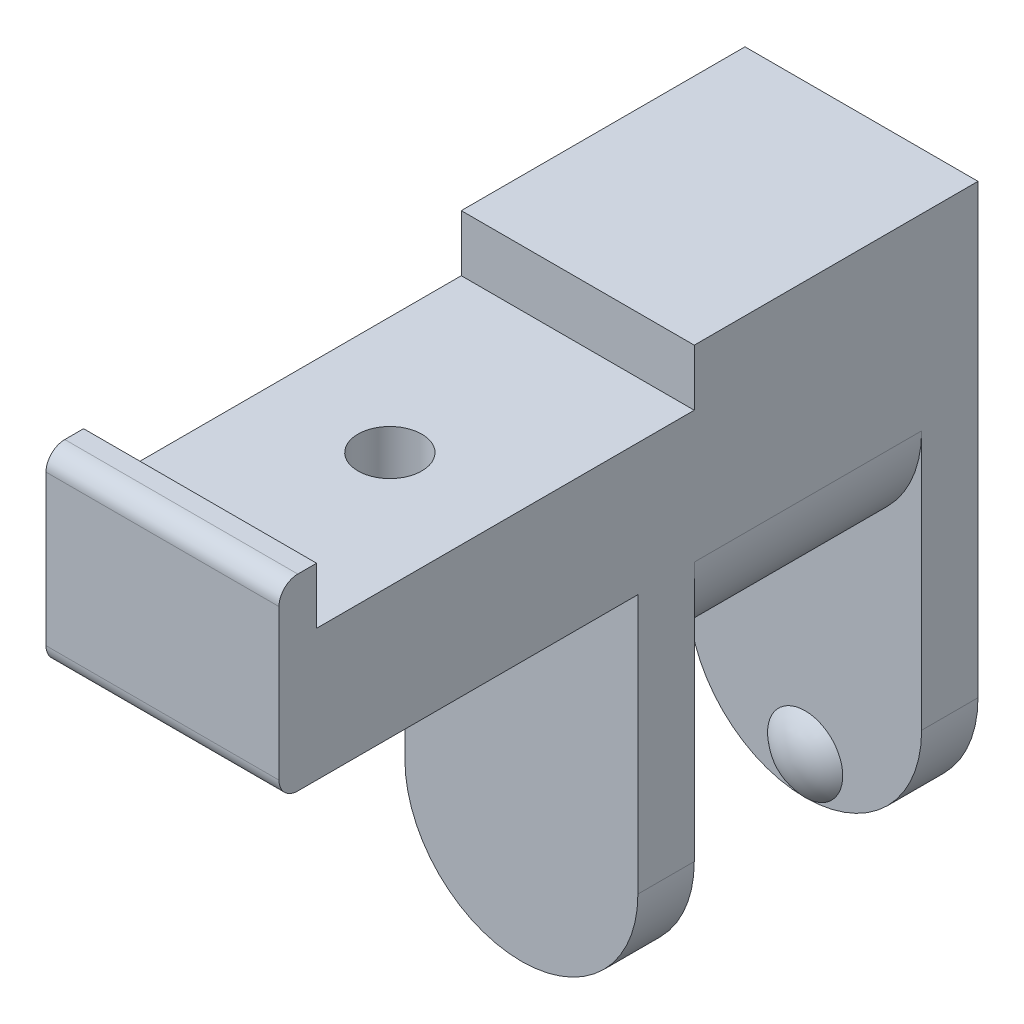
ISO-10303-21;
HEADER;
FILE_DESCRIPTION(('STEP AP214'),'2;1');
FILE_NAME('part.step','',(''),(''),'','','');
FILE_SCHEMA(('AUTOMOTIVE_DESIGN { 1 0 10303 214 1 1 1 1 }'));
ENDSEC;
DATA;
#1=APPLICATION_CONTEXT('core data for automotive mechanical design processes');
#2=APPLICATION_PROTOCOL_DEFINITION('international standard','automotive_design',2000,#1);
#3=PRODUCT_CONTEXT('',#1,'mechanical');
#4=PRODUCT('Part','Part','',(#3));
#5=PRODUCT_RELATED_PRODUCT_CATEGORY('part','',(#4));
#6=PRODUCT_DEFINITION_FORMATION('','',#4);
#7=PRODUCT_DEFINITION_CONTEXT('part definition',#1,'design');
#8=PRODUCT_DEFINITION('design','',#6,#7);
#9=PRODUCT_DEFINITION_SHAPE('','',#8);
#10=(LENGTH_UNIT() NAMED_UNIT(*) SI_UNIT(.MILLI.,.METRE.));
#11=(NAMED_UNIT(*) PLANE_ANGLE_UNIT() SI_UNIT($,.RADIAN.));
#12=(NAMED_UNIT(*) SI_UNIT($,.STERADIAN.) SOLID_ANGLE_UNIT());
#13=UNCERTAINTY_MEASURE_WITH_UNIT(LENGTH_MEASURE(1.E-05),#10,'distance_accuracy_value','');
#14=(GEOMETRIC_REPRESENTATION_CONTEXT(3) GLOBAL_UNCERTAINTY_ASSIGNED_CONTEXT((#13)) GLOBAL_UNIT_ASSIGNED_CONTEXT((#10,
#11,#12)) REPRESENTATION_CONTEXT('',''));
#15=CARTESIAN_POINT('',(0.,0.,0.));
#16=DIRECTION('',(0.,0.,1.));
#17=DIRECTION('',(1.,0.,0.));
#18=AXIS2_PLACEMENT_3D('',#15,#16,#17);
#19=CARTESIAN_POINT('',(12.4,0.,3.));
#20=DIRECTION('',(0.,0.,-1.));
#21=DIRECTION('',(0.,1.,0.));
#22=AXIS2_PLACEMENT_3D('',#19,#20,#21);
#23=PLANE('',#22);
#24=DIRECTION('',(0.,-1.,0.));
#25=VECTOR('',#24,1.);
#26=CARTESIAN_POINT('',(0.,0.,3.));
#27=LINE('',#26,#25);
#28=CARTESIAN_POINT('',(0.,0.,3.));
#29=VERTEX_POINT('',#28);
#30=CARTESIAN_POINT('',(0.,-13.8,3.));
#31=VERTEX_POINT('',#30);
#32=EDGE_CURVE('E257',#29,#31,#27,.T.);
#33=ORIENTED_EDGE('',*,*,#32,.T.);
#34=CARTESIAN_POINT('',(6.2,-13.8,3.));
#35=DIRECTION('',(0.,0.,-1.));
#36=DIRECTION('',(0.,1.,0.));
#37=AXIS2_PLACEMENT_3D('',#34,#35,#36);
#38=CIRCLE('',#37,6.2);
#39=CARTESIAN_POINT('',(12.4,-13.8,3.));
#40=VERTEX_POINT('',#39);
#41=EDGE_CURVE('E282',#31,#40,#38,.F.);
#42=ORIENTED_EDGE('',*,*,#41,.T.);
#43=DIRECTION('',(0.,-1.,0.));
#44=VECTOR('',#43,1.);
#45=CARTESIAN_POINT('',(12.4,0.,3.));
#46=LINE('',#45,#44);
#47=CARTESIAN_POINT('',(12.4,0.,3.));
#48=VERTEX_POINT('',#47);
#49=EDGE_CURVE('E244',#48,#40,#46,.T.);
#50=ORIENTED_EDGE('',*,*,#49,.F.);
#51=DIRECTION('',(-1.,0.,0.));
#52=VECTOR('',#51,1.);
#53=CARTESIAN_POINT('',(12.4,0.,3.));
#54=LINE('',#53,#52);
#55=EDGE_CURVE('E207',#48,#29,#54,.T.);
#56=ORIENTED_EDGE('',*,*,#55,.T.);
#57=EDGE_LOOP('',(#33,#42,#50,#56));
#58=FACE_BOUND('',#57,.T.);
#59=ADVANCED_FACE('F42',(#58),#23,.F.);
#60=CARTESIAN_POINT('',(12.4,0.,0.));
#61=DIRECTION('',(0.,0.,1.));
#62=DIRECTION('',(1.,0.,0.));
#63=AXIS2_PLACEMENT_3D('',#60,#61,#62);
#64=PLANE('',#63);
#65=DIRECTION('',(0.,1.,0.));
#66=VECTOR('',#65,1.);
#67=CARTESIAN_POINT('',(12.4,0.,0.));
#68=LINE('',#67,#66);
#69=CARTESIAN_POINT('',(12.4,-13.8,0.));
#70=VERTEX_POINT('',#69);
#71=CARTESIAN_POINT('',(12.4,0.,0.));
#72=VERTEX_POINT('',#71);
#73=EDGE_CURVE('E297',#70,#72,#68,.T.);
#74=ORIENTED_EDGE('',*,*,#73,.F.);
#75=CARTESIAN_POINT('',(6.2,-13.8,0.));
#76=DIRECTION('',(0.,0.,1.));
#77=DIRECTION('',(1.,0.,0.));
#78=AXIS2_PLACEMENT_3D('',#75,#76,#77);
#79=CIRCLE('',#78,6.2);
#80=CARTESIAN_POINT('',(0.,-13.8,0.));
#81=VERTEX_POINT('',#80);
#82=EDGE_CURVE('E272',#70,#81,#79,.F.);
#83=ORIENTED_EDGE('',*,*,#82,.T.);
#84=DIRECTION('',(0.,1.,0.));
#85=VECTOR('',#84,1.);
#86=CARTESIAN_POINT('',(0.,0.,0.));
#87=LINE('',#86,#85);
#88=CARTESIAN_POINT('',(0.,0.,0.));
#89=VERTEX_POINT('',#88);
#90=EDGE_CURVE('E189',#81,#89,#87,.T.);
#91=ORIENTED_EDGE('',*,*,#90,.T.);
#92=CARTESIAN_POINT('',(6.2,0.,0.));
#93=DIRECTION('',(0.,0.,-1.));
#94=DIRECTION('',(1.,0.,0.));
#95=AXIS2_PLACEMENT_3D('',#92,#93,#94);
#96=CIRCLE('',#95,6.2);
#97=EDGE_CURVE('E271',#72,#89,#96,.T.);
#98=ORIENTED_EDGE('',*,*,#97,.F.);
#99=EDGE_LOOP('',(#74,#83,#91,#98));
#100=FACE_BOUND('',#99,.T.);
#101=ADVANCED_FACE('F270',(#100),#64,.F.);
#102=CARTESIAN_POINT('',(12.4,0.,-12.1));
#103=DIRECTION('',(0.,0.,-1.));
#104=DIRECTION('',(0.,1.,0.));
#105=AXIS2_PLACEMENT_3D('',#102,#103,#104);
#106=PLANE('',#105);
#107=CARTESIAN_POINT('',(6.2,-13.8,-12.1));
#108=DIRECTION('',(0.,0.,-1.));
#109=DIRECTION('',(0.,1.,0.));
#110=AXIS2_PLACEMENT_3D('',#107,#108,#109);
#111=CIRCLE('',#110,6.2);
#112=CARTESIAN_POINT('',(0.,-13.8,-12.1));
#113=VERTEX_POINT('',#112);
#114=CARTESIAN_POINT('',(6.2,-20.,-12.1));
#115=VERTEX_POINT('',#114);
#116=EDGE_CURVE('E164',#113,#115,#111,.F.);
#117=ORIENTED_EDGE('',*,*,#116,.T.);
#118=CARTESIAN_POINT('',(6.2,-18.,-12.1));
#119=DIRECTION('',(0.,0.,1.));
#120=DIRECTION('',(1.,0.,0.));
#121=AXIS2_PLACEMENT_3D('',#118,#119,#120);
#122=CIRCLE('',#121,2.);
#123=EDGE_CURVE('E55',#115,#115,#122,.T.);
#124=ORIENTED_EDGE('',*,*,#123,.F.);
#125=CARTESIAN_POINT('',(12.4,-13.8,-12.1));
#126=VERTEX_POINT('',#125);
#127=EDGE_CURVE('E399',#115,#126,#111,.F.);
#128=ORIENTED_EDGE('',*,*,#127,.T.);
#129=DIRECTION('',(0.,-1.,0.));
#130=VECTOR('',#129,1.);
#131=CARTESIAN_POINT('',(12.4,0.,-12.1));
#132=LINE('',#131,#130);
#133=CARTESIAN_POINT('',(12.4,0.,-12.1));
#134=VERTEX_POINT('',#133);
#135=EDGE_CURVE('E299',#134,#126,#132,.T.);
#136=ORIENTED_EDGE('',*,*,#135,.F.);
#137=CARTESIAN_POINT('',(6.2,0.,-12.1));
#138=DIRECTION('',(0.,0.,-1.));
#139=DIRECTION('',(0.,1.,0.));
#140=AXIS2_PLACEMENT_3D('',#137,#138,#139);
#141=CIRCLE('',#140,6.2);
#142=CARTESIAN_POINT('',(0.,0.,-12.1));
#143=VERTEX_POINT('',#142);
#144=EDGE_CURVE('E285',#134,#143,#141,.T.);
#145=ORIENTED_EDGE('',*,*,#144,.T.);
#146=DIRECTION('',(0.,-1.,0.));
#147=VECTOR('',#146,1.);
#148=CARTESIAN_POINT('',(0.,0.,-12.1));
#149=LINE('',#148,#147);
#150=EDGE_CURVE('E185',#143,#113,#149,.T.);
#151=ORIENTED_EDGE('',*,*,#150,.T.);
#152=EDGE_LOOP('',(#117,#124,#128,#136,#145,#151));
#153=FACE_BOUND('',#152,.T.);
#154=ADVANCED_FACE('F341',(#153),#106,.F.);
#155=CARTESIAN_POINT('',(12.4,0.,-15.1));
#156=DIRECTION('',(0.,0.,1.));
#157=DIRECTION('',(0.,-1.,0.));
#158=AXIS2_PLACEMENT_3D('',#155,#156,#157);
#159=PLANE('',#158);
#160=DIRECTION('',(0.,1.,0.));
#161=VECTOR('',#160,1.);
#162=CARTESIAN_POINT('',(12.4,0.,-15.1));
#163=LINE('',#162,#161);
#164=CARTESIAN_POINT('',(12.4,-13.8,-15.1));
#165=VERTEX_POINT('',#164);
#166=CARTESIAN_POINT('',(12.4,10.,-15.1));
#167=VERTEX_POINT('',#166);
#168=EDGE_CURVE('E176',#165,#167,#163,.T.);
#169=ORIENTED_EDGE('',*,*,#168,.F.);
#170=CARTESIAN_POINT('',(6.2,-13.8,-15.1));
#171=DIRECTION('',(0.,0.,-1.));
#172=DIRECTION('',(1.,0.,0.));
#173=AXIS2_PLACEMENT_3D('',#170,#171,#172);
#174=CIRCLE('',#173,6.2);
#175=CARTESIAN_POINT('',(0.,-13.8,-15.1));
#176=VERTEX_POINT('',#175);
#177=EDGE_CURVE('E160',#165,#176,#174,.T.);
#178=ORIENTED_EDGE('',*,*,#177,.T.);
#179=DIRECTION('',(0.,1.,0.));
#180=VECTOR('',#179,1.);
#181=CARTESIAN_POINT('',(0.,0.,-15.1));
#182=LINE('',#181,#180);
#183=CARTESIAN_POINT('',(0.,10.,-15.1));
#184=VERTEX_POINT('',#183);
#185=EDGE_CURVE('E174',#176,#184,#182,.T.);
#186=ORIENTED_EDGE('',*,*,#185,.T.);
#187=DIRECTION('',(-1.,0.,0.));
#188=VECTOR('',#187,1.);
#189=CARTESIAN_POINT('',(12.4,10.,-15.1));
#190=LINE('',#189,#188);
#191=EDGE_CURVE('E205',#167,#184,#190,.T.);
#192=ORIENTED_EDGE('',*,*,#191,.F.);
#193=EDGE_LOOP('',(#169,#178,#186,#192));
#194=FACE_BOUND('',#193,.T.);
#195=ADVANCED_FACE('F172',(#194),#159,.F.);
#196=CARTESIAN_POINT('',(12.4,0.,20.1));
#197=DIRECTION('',(0.,0.,-1.));
#198=DIRECTION('',(0.,1.,0.));
#199=AXIS2_PLACEMENT_3D('',#196,#197,#198);
#200=PLANE('',#199);
#201=DIRECTION('',(0.,-1.,0.));
#202=VECTOR('',#201,1.);
#203=CARTESIAN_POINT('',(0.,0.,20.1));
#204=LINE('',#203,#202);
#205=CARTESIAN_POINT('',(0.,9.99999999999999,20.1));
#206=VERTEX_POINT('',#205);
#207=CARTESIAN_POINT('',(0.,6.99999999999999,20.1));
#208=VERTEX_POINT('',#207);
#209=EDGE_CURVE('E259',#206,#208,#204,.T.);
#210=ORIENTED_EDGE('',*,*,#209,.F.);
#211=DIRECTION('',(-1.,0.,0.));
#212=VECTOR('',#211,1.);
#213=CARTESIAN_POINT('',(12.4,9.99999999999999,20.1));
#214=LINE('',#213,#212);
#215=CARTESIAN_POINT('',(12.4,9.99999999999999,20.1));
#216=VERTEX_POINT('',#215);
#217=EDGE_CURVE('E210',#216,#206,#214,.T.);
#218=ORIENTED_EDGE('',*,*,#217,.F.);
#219=DIRECTION('',(0.,-1.,0.));
#220=VECTOR('',#219,1.);
#221=CARTESIAN_POINT('',(12.4,0.,20.1));
#222=LINE('',#221,#220);
#223=CARTESIAN_POINT('',(12.4,6.99999999999999,20.1));
#224=VERTEX_POINT('',#223);
#225=EDGE_CURVE('E197',#216,#224,#222,.T.);
#226=ORIENTED_EDGE('',*,*,#225,.T.);
#227=DIRECTION('',(-1.,0.,0.));
#228=VECTOR('',#227,1.);
#229=CARTESIAN_POINT('',(12.4,6.99999999999999,20.1));
#230=LINE('',#229,#228);
#231=EDGE_CURVE('E198',#224,#208,#230,.T.);
#232=ORIENTED_EDGE('',*,*,#231,.T.);
#233=EDGE_LOOP('',(#210,#218,#226,#232));
#234=FACE_BOUND('',#233,.T.);
#235=ADVANCED_FACE('F323',(#234),#200,.T.);
#236=CARTESIAN_POINT('',(12.4,9.99999999999999,0.));
#237=DIRECTION('',(0.,-1.,0.));
#238=DIRECTION('',(0.,0.,-1.));
#239=AXIS2_PLACEMENT_3D('',#236,#237,#238);
#240=PLANE('',#239);
#241=DIRECTION('',(0.,0.,1.));
#242=VECTOR('',#241,1.);
#243=CARTESIAN_POINT('',(0.,9.99999999999999,0.));
#244=LINE('',#243,#242);
#245=CARTESIAN_POINT('',(0.,9.99999999999999,21.1));
#246=VERTEX_POINT('',#245);
#247=EDGE_CURVE('E255',#206,#246,#244,.T.);
#248=ORIENTED_EDGE('',*,*,#247,.T.);
#249=DIRECTION('',(-1.,0.,0.));
#250=VECTOR('',#249,1.);
#251=CARTESIAN_POINT('',(12.4,9.99999999999999,21.1));
#252=LINE('',#251,#250);
#253=CARTESIAN_POINT('',(12.4,9.99999999999999,21.1));
#254=VERTEX_POINT('',#253);
#255=EDGE_CURVE('E11',#246,#254,#252,.F.);
#256=ORIENTED_EDGE('',*,*,#255,.T.);
#257=DIRECTION('',(0.,0.,1.));
#258=VECTOR('',#257,1.);
#259=CARTESIAN_POINT('',(12.4,9.99999999999999,0.));
#260=LINE('',#259,#258);
#261=EDGE_CURVE('E293',#216,#254,#260,.T.);
#262=ORIENTED_EDGE('',*,*,#261,.F.);
#263=ORIENTED_EDGE('',*,*,#217,.T.);
#264=EDGE_LOOP('',(#248,#256,#262,#263));
#265=FACE_BOUND('',#264,.T.);
#266=ADVANCED_FACE('F324',(#265),#240,.F.);
#267=CARTESIAN_POINT('',(12.4,0.,22.1));
#268=DIRECTION('',(0.,0.,-1.));
#269=DIRECTION('',(-1.,0.,0.));
#270=AXIS2_PLACEMENT_3D('',#267,#268,#269);
#271=PLANE('',#270);
#272=DIRECTION('',(0.,-1.,0.));
#273=VECTOR('',#272,1.);
#274=CARTESIAN_POINT('',(0.,0.,22.1));
#275=LINE('',#274,#273);
#276=CARTESIAN_POINT('',(0.,8.99999999999999,22.1));
#277=VERTEX_POINT('',#276);
#278=CARTESIAN_POINT('',(0.,1.,22.1));
#279=VERTEX_POINT('',#278);
#280=EDGE_CURVE('E249',#277,#279,#275,.T.);
#281=ORIENTED_EDGE('',*,*,#280,.T.);
#282=DIRECTION('',(-1.,0.,0.));
#283=VECTOR('',#282,1.);
#284=CARTESIAN_POINT('',(12.4,1.,22.1));
#285=LINE('',#284,#283);
#286=CARTESIAN_POINT('',(12.4,1.,22.1));
#287=VERTEX_POINT('',#286);
#288=EDGE_CURVE('E225',#279,#287,#285,.F.);
#289=ORIENTED_EDGE('',*,*,#288,.T.);
#290=DIRECTION('',(0.,-1.,0.));
#291=VECTOR('',#290,1.);
#292=CARTESIAN_POINT('',(12.4,0.,22.1));
#293=LINE('',#292,#291);
#294=CARTESIAN_POINT('',(12.4,8.99999999999999,22.1));
#295=VERTEX_POINT('',#294);
#296=EDGE_CURVE('E237',#295,#287,#293,.T.);
#297=ORIENTED_EDGE('',*,*,#296,.F.);
#298=DIRECTION('',(-1.,0.,0.));
#299=VECTOR('',#298,1.);
#300=CARTESIAN_POINT('',(12.4,8.99999999999999,22.1));
#301=LINE('',#300,#299);
#302=EDGE_CURVE('E222',#295,#277,#301,.T.);
#303=ORIENTED_EDGE('',*,*,#302,.T.);
#304=EDGE_LOOP('',(#281,#289,#297,#303));
#305=FACE_BOUND('',#304,.T.);
#306=ADVANCED_FACE('F253',(#305),#271,.F.);
#307=CARTESIAN_POINT('',(12.4,0.,0.));
#308=DIRECTION('',(0.,1.,0.));
#309=DIRECTION('',(0.,0.,1.));
#310=AXIS2_PLACEMENT_3D('',#307,#308,#309);
#311=PLANE('',#310);
#312=CARTESIAN_POINT('',(6.25,0.,10.05));
#313=DIRECTION('',(0.,1.,0.));
#314=DIRECTION('',(0.,0.,1.));
#315=AXIS2_PLACEMENT_3D('',#312,#313,#314);
#316=CIRCLE('',#315,1.7);
#317=CARTESIAN_POINT('',(6.25,0.,11.75));
#318=VERTEX_POINT('',#317);
#319=EDGE_CURVE('E177',#318,#318,#316,.T.);
#320=ORIENTED_EDGE('',*,*,#319,.T.);
#321=EDGE_LOOP('',(#320));
#322=FACE_BOUND('',#321,.T.);
#323=DIRECTION('',(0.,0.,-1.));
#324=VECTOR('',#323,1.);
#325=CARTESIAN_POINT('',(12.4,0.,0.));
#326=LINE('',#325,#324);
#327=CARTESIAN_POINT('',(12.4,0.,21.1));
#328=VERTEX_POINT('',#327);
#329=EDGE_CURVE('E234',#328,#48,#326,.T.);
#330=ORIENTED_EDGE('',*,*,#329,.F.);
#331=DIRECTION('',(-1.,0.,0.));
#332=VECTOR('',#331,1.);
#333=CARTESIAN_POINT('',(12.4,0.,21.1));
#334=LINE('',#333,#332);
#335=CARTESIAN_POINT('',(0.,0.,21.1));
#336=VERTEX_POINT('',#335);
#337=EDGE_CURVE('E215',#328,#336,#334,.T.);
#338=ORIENTED_EDGE('',*,*,#337,.T.);
#339=DIRECTION('',(0.,0.,-1.));
#340=VECTOR('',#339,1.);
#341=CARTESIAN_POINT('',(0.,0.,0.));
#342=LINE('',#341,#340);
#343=EDGE_CURVE('E251',#336,#29,#342,.T.);
#344=ORIENTED_EDGE('',*,*,#343,.T.);
#345=ORIENTED_EDGE('',*,*,#55,.F.);
#346=EDGE_LOOP('',(#330,#338,#344,#345));
#347=FACE_BOUND('',#346,.T.);
#348=ADVANCED_FACE('F242',(#322,#347),#311,.F.);
#349=CARTESIAN_POINT('',(12.4,10.,0.));
#350=DIRECTION('',(0.,-1.,0.));
#351=DIRECTION('',(0.,0.,-1.));
#352=AXIS2_PLACEMENT_3D('',#349,#350,#351);
#353=PLANE('',#352);
#354=DIRECTION('',(0.,0.,1.));
#355=VECTOR('',#354,1.);
#356=CARTESIAN_POINT('',(0.,10.,0.));
#357=LINE('',#356,#355);
#358=CARTESIAN_POINT('',(0.,10.,0.));
#359=VERTEX_POINT('',#358);
#360=EDGE_CURVE('E184',#184,#359,#357,.T.);
#361=ORIENTED_EDGE('',*,*,#360,.T.);
#362=DIRECTION('',(-1.,0.,0.));
#363=VECTOR('',#362,1.);
#364=CARTESIAN_POINT('',(12.4,10.,0.));
#365=LINE('',#364,#363);
#366=CARTESIAN_POINT('',(12.4,10.,0.));
#367=VERTEX_POINT('',#366);
#368=EDGE_CURVE('E203',#367,#359,#365,.T.);
#369=ORIENTED_EDGE('',*,*,#368,.F.);
#370=DIRECTION('',(0.,0.,1.));
#371=VECTOR('',#370,1.);
#372=CARTESIAN_POINT('',(12.4,10.,0.));
#373=LINE('',#372,#371);
#374=EDGE_CURVE('E303',#167,#367,#373,.T.);
#375=ORIENTED_EDGE('',*,*,#374,.F.);
#376=ORIENTED_EDGE('',*,*,#191,.T.);
#377=EDGE_LOOP('',(#361,#369,#375,#376));
#378=FACE_BOUND('',#377,.T.);
#379=ADVANCED_FACE('F347',(#378),#353,.F.);
#380=CARTESIAN_POINT('',(12.4,0.,0.));
#381=DIRECTION('',(0.,0.,1.));
#382=DIRECTION('',(1.,0.,0.));
#383=AXIS2_PLACEMENT_3D('',#380,#381,#382);
#384=PLANE('',#383);
#385=DIRECTION('',(0.,1.,0.));
#386=VECTOR('',#385,1.);
#387=CARTESIAN_POINT('',(0.,0.,0.));
#388=LINE('',#387,#386);
#389=CARTESIAN_POINT('',(0.,6.99999999999999,0.));
#390=VERTEX_POINT('',#389);
#391=EDGE_CURVE('E187',#390,#359,#388,.T.);
#392=ORIENTED_EDGE('',*,*,#391,.F.);
#393=DIRECTION('',(-1.,0.,0.));
#394=VECTOR('',#393,1.);
#395=CARTESIAN_POINT('',(12.4,6.99999999999999,0.));
#396=LINE('',#395,#394);
#397=CARTESIAN_POINT('',(12.4,6.99999999999999,0.));
#398=VERTEX_POINT('',#397);
#399=EDGE_CURVE('E200',#398,#390,#396,.T.);
#400=ORIENTED_EDGE('',*,*,#399,.F.);
#401=DIRECTION('',(0.,1.,0.));
#402=VECTOR('',#401,1.);
#403=CARTESIAN_POINT('',(12.4,0.,0.));
#404=LINE('',#403,#402);
#405=EDGE_CURVE('E305',#398,#367,#404,.T.);
#406=ORIENTED_EDGE('',*,*,#405,.T.);
#407=ORIENTED_EDGE('',*,*,#368,.T.);
#408=EDGE_LOOP('',(#392,#400,#406,#407));
#409=FACE_BOUND('',#408,.T.);
#410=ADVANCED_FACE('F319',(#409),#384,.T.);
#411=CARTESIAN_POINT('',(12.4,6.99999999999999,0.));
#412=DIRECTION('',(0.,1.,0.));
#413=DIRECTION('',(0.,0.,1.));
#414=AXIS2_PLACEMENT_3D('',#411,#412,#413);
#415=PLANE('',#414);
#416=CARTESIAN_POINT('',(6.25,6.99999999999999,10.05));
#417=DIRECTION('',(0.,1.,0.));
#418=DIRECTION('',(0.,0.,1.));
#419=AXIS2_PLACEMENT_3D('',#416,#417,#418);
#420=CIRCLE('',#419,1.7);
#421=CARTESIAN_POINT('',(6.25,6.99999999999999,11.75));
#422=VERTEX_POINT('',#421);
#423=EDGE_CURVE('E391',#422,#422,#420,.T.);
#424=ORIENTED_EDGE('',*,*,#423,.F.);
#425=EDGE_LOOP('',(#424));
#426=FACE_BOUND('',#425,.T.);
#427=DIRECTION('',(0.,0.,-1.));
#428=VECTOR('',#427,1.);
#429=CARTESIAN_POINT('',(0.,6.99999999999999,0.));
#430=LINE('',#429,#428);
#431=EDGE_CURVE('E194',#208,#390,#430,.T.);
#432=ORIENTED_EDGE('',*,*,#431,.F.);
#433=ORIENTED_EDGE('',*,*,#231,.F.);
#434=DIRECTION('',(0.,0.,-1.));
#435=VECTOR('',#434,1.);
#436=CARTESIAN_POINT('',(12.4,6.99999999999999,0.));
#437=LINE('',#436,#435);
#438=EDGE_CURVE('E201',#224,#398,#437,.T.);
#439=ORIENTED_EDGE('',*,*,#438,.T.);
#440=ORIENTED_EDGE('',*,*,#399,.T.);
#441=EDGE_LOOP('',(#432,#433,#439,#440));
#442=FACE_BOUND('',#441,.T.);
#443=ADVANCED_FACE('F312',(#426,#442),#415,.T.);
#444=CARTESIAN_POINT('',(12.4,0.,0.));
#445=DIRECTION('',(1.,0.,0.));
#446=DIRECTION('',(0.,0.,-1.));
#447=AXIS2_PLACEMENT_3D('',#444,#445,#446);
#448=PLANE('',#447);
#449=ORIENTED_EDGE('',*,*,#296,.T.);
#450=CARTESIAN_POINT('',(12.4,1.,21.1));
#451=DIRECTION('',(1.,0.,0.));
#452=DIRECTION('',(0.,0.,-1.));
#453=AXIS2_PLACEMENT_3D('',#450,#451,#452);
#454=CIRCLE('',#453,1.);
#455=EDGE_CURVE('E50',#287,#328,#454,.T.);
#456=ORIENTED_EDGE('',*,*,#455,.T.);
#457=ORIENTED_EDGE('',*,*,#329,.T.);
#458=ORIENTED_EDGE('',*,*,#49,.T.);
#459=DIRECTION('',(0.,0.,1.));
#460=VECTOR('',#459,1.);
#461=CARTESIAN_POINT('',(12.4,-13.8,-15.1));
#462=LINE('',#461,#460);
#463=EDGE_CURVE('E168',#70,#40,#462,.T.);
#464=ORIENTED_EDGE('',*,*,#463,.F.);
#465=ORIENTED_EDGE('',*,*,#73,.T.);
#466=DIRECTION('',(0.,0.,1.));
#467=VECTOR('',#466,1.);
#468=CARTESIAN_POINT('',(12.4,0.,-35.5130263801639));
#469=LINE('',#468,#467);
#470=EDGE_CURVE('E281',#134,#72,#469,.T.);
#471=ORIENTED_EDGE('',*,*,#470,.F.);
#472=ORIENTED_EDGE('',*,*,#135,.T.);
#473=EDGE_CURVE('E398',#165,#126,#462,.T.);
#474=ORIENTED_EDGE('',*,*,#473,.F.);
#475=ORIENTED_EDGE('',*,*,#168,.T.);
#476=ORIENTED_EDGE('',*,*,#374,.T.);
#477=ORIENTED_EDGE('',*,*,#405,.F.);
#478=ORIENTED_EDGE('',*,*,#438,.F.);
#479=ORIENTED_EDGE('',*,*,#225,.F.);
#480=ORIENTED_EDGE('',*,*,#261,.T.);
#481=CARTESIAN_POINT('',(12.4,8.99999999999999,21.1));
#482=DIRECTION('',(1.,0.,0.));
#483=DIRECTION('',(0.,0.,-1.));
#484=AXIS2_PLACEMENT_3D('',#481,#482,#483);
#485=CIRCLE('',#484,1.);
#486=EDGE_CURVE('E227',#254,#295,#485,.T.);
#487=ORIENTED_EDGE('',*,*,#486,.T.);
#488=EDGE_LOOP('',(#449,#456,#457,#458,#464,#465,#471,#472,#474,#475,#476,#477,#478,#479,#480,#487));
#489=FACE_BOUND('',#488,.T.);
#490=ADVANCED_FACE('F232',(#489),#448,.T.);
#491=CARTESIAN_POINT('',(0.,0.,0.));
#492=DIRECTION('',(1.,0.,0.));
#493=DIRECTION('',(0.,0.,-1.));
#494=AXIS2_PLACEMENT_3D('',#491,#492,#493);
#495=PLANE('',#494);
#496=ORIENTED_EDGE('',*,*,#343,.F.);
#497=CARTESIAN_POINT('',(0.,1.,21.1));
#498=DIRECTION('',(1.,0.,0.));
#499=DIRECTION('',(0.,0.,-1.));
#500=AXIS2_PLACEMENT_3D('',#497,#498,#499);
#501=CIRCLE('',#500,1.);
#502=EDGE_CURVE('E220',#336,#279,#501,.F.);
#503=ORIENTED_EDGE('',*,*,#502,.T.);
#504=ORIENTED_EDGE('',*,*,#280,.F.);
#505=CARTESIAN_POINT('',(0.,8.99999999999999,21.1));
#506=DIRECTION('',(1.,0.,0.));
#507=DIRECTION('',(0.,0.,-1.));
#508=AXIS2_PLACEMENT_3D('',#505,#506,#507);
#509=CIRCLE('',#508,1.);
#510=EDGE_CURVE('E218',#277,#246,#509,.F.);
#511=ORIENTED_EDGE('',*,*,#510,.T.);
#512=ORIENTED_EDGE('',*,*,#247,.F.);
#513=ORIENTED_EDGE('',*,*,#209,.T.);
#514=ORIENTED_EDGE('',*,*,#431,.T.);
#515=ORIENTED_EDGE('',*,*,#391,.T.);
#516=ORIENTED_EDGE('',*,*,#360,.F.);
#517=ORIENTED_EDGE('',*,*,#185,.F.);
#518=DIRECTION('',(0.,0.,1.));
#519=VECTOR('',#518,1.);
#520=CARTESIAN_POINT('',(0.,-13.8,-15.1));
#521=LINE('',#520,#519);
#522=EDGE_CURVE('E156',#176,#113,#521,.T.);
#523=ORIENTED_EDGE('',*,*,#522,.T.);
#524=ORIENTED_EDGE('',*,*,#150,.F.);
#525=DIRECTION('',(0.,0.,1.));
#526=VECTOR('',#525,1.);
#527=CARTESIAN_POINT('',(0.,0.,-35.5130263801639));
#528=LINE('',#527,#526);
#529=EDGE_CURVE('E279',#143,#89,#528,.T.);
#530=ORIENTED_EDGE('',*,*,#529,.T.);
#531=ORIENTED_EDGE('',*,*,#90,.F.);
#532=DIRECTION('',(0.,0.,1.));
#533=VECTOR('',#532,1.);
#534=CARTESIAN_POINT('',(0.,-13.8,0.));
#535=LINE('',#534,#533);
#536=EDGE_CURVE('E212',#81,#31,#535,.T.);
#537=ORIENTED_EDGE('',*,*,#536,.T.);
#538=ORIENTED_EDGE('',*,*,#32,.F.);
#539=EDGE_LOOP('',(#496,#503,#504,#511,#512,#513,#514,#515,#516,#517,#523,#524,#530,#531,#537,#538));
#540=FACE_BOUND('',#539,.T.);
#541=ADVANCED_FACE('F181',(#540),#495,.F.);
#542=CARTESIAN_POINT('',(6.2,0.,-35.5130263801639));
#543=DIRECTION('',(0.,0.,1.));
#544=DIRECTION('',(1.,0.,0.));
#545=AXIS2_PLACEMENT_3D('',#542,#543,#544);
#546=CYLINDRICAL_SURFACE('',#545,6.2);
#547=ORIENTED_EDGE('',*,*,#470,.T.);
#548=ORIENTED_EDGE('',*,*,#97,.T.);
#549=ORIENTED_EDGE('',*,*,#529,.F.);
#550=ORIENTED_EDGE('',*,*,#144,.F.);
#551=EDGE_LOOP('',(#547,#548,#549,#550));
#552=FACE_BOUND('',#551,.T.);
#553=ADVANCED_FACE('F277',(#552),#546,.T.);
#554=CARTESIAN_POINT('',(6.2,-13.8,-15.1));
#555=DIRECTION('',(0.,0.,1.));
#556=DIRECTION('',(1.,0.,0.));
#557=AXIS2_PLACEMENT_3D('',#554,#555,#556);
#558=CYLINDRICAL_SURFACE('',#557,6.2);
#559=ORIENTED_EDGE('',*,*,#536,.F.);
#560=ORIENTED_EDGE('',*,*,#82,.F.);
#561=ORIENTED_EDGE('',*,*,#463,.T.);
#562=ORIENTED_EDGE('',*,*,#41,.F.);
#563=EDGE_LOOP('',(#559,#560,#561,#562));
#564=FACE_BOUND('',#563,.T.);
#565=ADVANCED_FACE('F378',(#564),#558,.T.);
#566=ORIENTED_EDGE('',*,*,#522,.F.);
#567=ORIENTED_EDGE('',*,*,#177,.F.);
#568=ORIENTED_EDGE('',*,*,#473,.T.);
#569=ORIENTED_EDGE('',*,*,#127,.F.);
#570=ORIENTED_EDGE('',*,*,#116,.F.);
#571=EDGE_LOOP('',(#566,#567,#568,#569,#570));
#572=FACE_BOUND('',#571,.T.);
#573=ADVANCED_FACE('F158',(#572),#558,.T.);
#574=CARTESIAN_POINT('',(6.25,6.99999999999999,10.05));
#575=DIRECTION('',(0.,1.,0.));
#576=DIRECTION('',(0.,0.,1.));
#577=AXIS2_PLACEMENT_3D('',#574,#575,#576);
#578=CYLINDRICAL_SURFACE('',#577,1.7);
#579=ORIENTED_EDGE('',*,*,#423,.T.);
#580=EDGE_LOOP('',(#579));
#581=FACE_BOUND('',#580,.T.);
#582=ORIENTED_EDGE('',*,*,#319,.F.);
#583=EDGE_LOOP('',(#582));
#584=FACE_BOUND('',#583,.T.);
#585=ADVANCED_FACE('F334',(#581,#584),#578,.F.);
#586=CARTESIAN_POINT('',(12.4,1.,21.1));
#587=DIRECTION('',(-1.,0.,0.));
#588=DIRECTION('',(0.,0.,1.));
#589=AXIS2_PLACEMENT_3D('',#586,#587,#588);
#590=CYLINDRICAL_SURFACE('',#589,1.);
#591=ORIENTED_EDGE('',*,*,#455,.F.);
#592=ORIENTED_EDGE('',*,*,#288,.F.);
#593=ORIENTED_EDGE('',*,*,#502,.F.);
#594=ORIENTED_EDGE('',*,*,#337,.F.);
#595=EDGE_LOOP('',(#591,#592,#593,#594));
#596=FACE_BOUND('',#595,.T.);
#597=ADVANCED_FACE('F246',(#596),#590,.T.);
#598=CARTESIAN_POINT('',(12.4,8.99999999999999,21.1));
#599=DIRECTION('',(-1.,0.,0.));
#600=DIRECTION('',(0.,0.,1.));
#601=AXIS2_PLACEMENT_3D('',#598,#599,#600);
#602=CYLINDRICAL_SURFACE('',#601,1.);
#603=ORIENTED_EDGE('',*,*,#486,.F.);
#604=ORIENTED_EDGE('',*,*,#255,.F.);
#605=ORIENTED_EDGE('',*,*,#510,.F.);
#606=ORIENTED_EDGE('',*,*,#302,.F.);
#607=EDGE_LOOP('',(#603,#604,#605,#606));
#608=FACE_BOUND('',#607,.T.);
#609=ADVANCED_FACE('F44',(#608),#602,.T.);
#610=CARTESIAN_POINT('',(6.2,-18.,-14.2));
#611=DIRECTION('',(0.,0.,1.));
#612=DIRECTION('',(0.,1.,0.));
#613=AXIS2_PLACEMENT_3D('',#610,#611,#612);
#614=SPHERICAL_SURFACE('',#613,2.89999999999999);
#615=ORIENTED_EDGE('',*,*,#123,.T.);
#616=EDGE_LOOP('',(#615));
#617=FACE_BOUND('',#616,.T.);
#618=ADVANCED_FACE('F328',(#617),#614,.T.);
#619=CLOSED_SHELL('',(#59,#101,#154,#195,#235,#266,#306,#348,#379,#410,#443,#490,#541,#553,#565,
#573,#585,#597,#609,#618));
#620=MANIFOLD_SOLID_BREP('B2',#619);
#621=ADVANCED_BREP_SHAPE_REPRESENTATION('',(#18,#620),#14);
#622=SHAPE_DEFINITION_REPRESENTATION(#9,#621);
ENDSEC;
END-ISO-10303-21;
